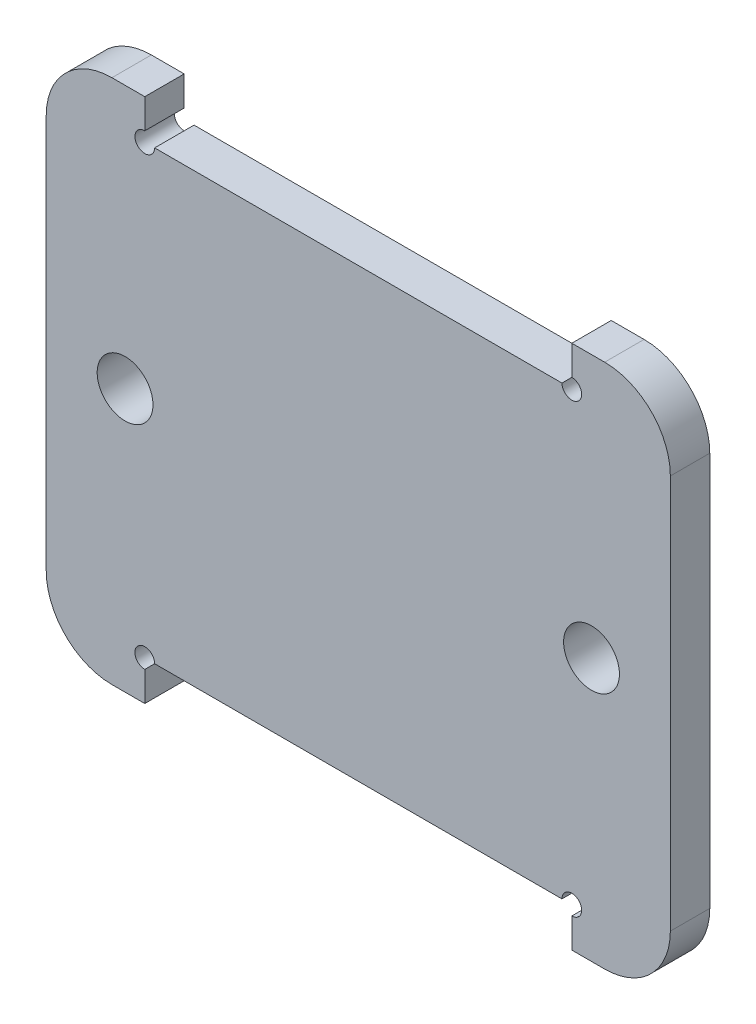
ISO-10303-21;
HEADER;
FILE_DESCRIPTION(('STEP AP214'),'2;1');
FILE_NAME('part.step','',(''),(''),'','','');
FILE_SCHEMA(('AUTOMOTIVE_DESIGN { 1 0 10303 214 1 1 1 1 }'));
ENDSEC;
DATA;
#1=APPLICATION_CONTEXT('core data for automotive mechanical design processes');
#2=APPLICATION_PROTOCOL_DEFINITION('international standard','automotive_design',2000,#1);
#3=PRODUCT_CONTEXT('',#1,'mechanical');
#4=PRODUCT('Part','Part','',(#3));
#5=PRODUCT_RELATED_PRODUCT_CATEGORY('part','',(#4));
#6=PRODUCT_DEFINITION_FORMATION('','',#4);
#7=PRODUCT_DEFINITION_CONTEXT('part definition',#1,'design');
#8=PRODUCT_DEFINITION('design','',#6,#7);
#9=PRODUCT_DEFINITION_SHAPE('','',#8);
#10=(LENGTH_UNIT() NAMED_UNIT(*) SI_UNIT(.MILLI.,.METRE.));
#11=(NAMED_UNIT(*) PLANE_ANGLE_UNIT() SI_UNIT($,.RADIAN.));
#12=(NAMED_UNIT(*) SI_UNIT($,.STERADIAN.) SOLID_ANGLE_UNIT());
#13=UNCERTAINTY_MEASURE_WITH_UNIT(LENGTH_MEASURE(1.E-05),#10,'distance_accuracy_value','');
#14=(GEOMETRIC_REPRESENTATION_CONTEXT(3) GLOBAL_UNCERTAINTY_ASSIGNED_CONTEXT((#13)) GLOBAL_UNIT_ASSIGNED_CONTEXT((#10,
#11,#12)) REPRESENTATION_CONTEXT('',''));
#15=CARTESIAN_POINT('',(0.,0.,0.));
#16=DIRECTION('',(0.,0.,1.));
#17=DIRECTION('',(1.,0.,0.));
#18=AXIS2_PLACEMENT_3D('',#15,#16,#17);
#19=CARTESIAN_POINT('',(-310.,90.,6.00000000000001));
#20=DIRECTION('',(0.,0.,-1.));
#21=DIRECTION('',(-1.,0.,0.));
#22=AXIS2_PLACEMENT_3D('',#19,#20,#21);
#23=PLANE('',#22);
#24=DIRECTION('',(1.,0.,0.));
#25=VECTOR('',#24,1.);
#26=CARTESIAN_POINT('',(-315.,26.,6.00000000000001));
#27=LINE('',#26,#25);
#28=CARTESIAN_POINT('',(-378.5,25.9999999999999,6.00000000000001));
#29=VERTEX_POINT('',#28);
#30=CARTESIAN_POINT('',(-316.5,26.,6.00000000000001));
#31=VERTEX_POINT('',#30);
#32=EDGE_CURVE('E192',#29,#31,#27,.T.);
#33=ORIENTED_EDGE('',*,*,#32,.T.);
#34=CARTESIAN_POINT('',(-315.,25.9999999999999,6.00000000000001));
#35=DIRECTION('',(0.,0.,1.));
#36=DIRECTION('',(-1.,0.,0.));
#37=AXIS2_PLACEMENT_3D('',#34,#35,#36);
#38=CIRCLE('',#37,1.50000000000002);
#39=CARTESIAN_POINT('',(-315.,24.4999999999999,6.00000000000001));
#40=VERTEX_POINT('',#39);
#41=EDGE_CURVE('E174',#40,#31,#38,.T.);
#42=ORIENTED_EDGE('',*,*,#41,.F.);
#43=DIRECTION('',(0.,-1.,0.));
#44=VECTOR('',#43,1.);
#45=CARTESIAN_POINT('',(-315.,20.,6.00000000000001));
#46=LINE('',#45,#44);
#47=CARTESIAN_POINT('',(-315.,20.,6.00000000000001));
#48=VERTEX_POINT('',#47);
#49=EDGE_CURVE('E204',#40,#48,#46,.T.);
#50=ORIENTED_EDGE('',*,*,#49,.T.);
#51=DIRECTION('',(1.,0.,0.));
#52=VECTOR('',#51,1.);
#53=CARTESIAN_POINT('',(-310.,20.,6.00000000000001));
#54=LINE('',#53,#52);
#55=CARTESIAN_POINT('',(-310.,20.,6.00000000000001));
#56=VERTEX_POINT('',#55);
#57=EDGE_CURVE('E210',#48,#56,#54,.T.);
#58=ORIENTED_EDGE('',*,*,#57,.T.);
#59=CARTESIAN_POINT('',(-310.,30.,6.00000000000001));
#60=DIRECTION('',(0.,0.,1.));
#61=DIRECTION('',(-1.,0.,0.));
#62=AXIS2_PLACEMENT_3D('',#59,#60,#61);
#63=CIRCLE('',#62,9.99999999999994);
#64=CARTESIAN_POINT('',(-300.,30.,6.00000000000001));
#65=VERTEX_POINT('',#64);
#66=EDGE_CURVE('E219',#56,#65,#63,.T.);
#67=ORIENTED_EDGE('',*,*,#66,.T.);
#68=DIRECTION('',(0.,1.,0.));
#69=VECTOR('',#68,1.);
#70=CARTESIAN_POINT('',(-300.,90.,6.00000000000001));
#71=LINE('',#70,#69);
#72=CARTESIAN_POINT('',(-300.,90.,6.00000000000001));
#73=VERTEX_POINT('',#72);
#74=EDGE_CURVE('E222',#65,#73,#71,.T.);
#75=ORIENTED_EDGE('',*,*,#74,.T.);
#76=CARTESIAN_POINT('',(-310.,90.,6.00000000000001));
#77=DIRECTION('',(0.,0.,1.));
#78=DIRECTION('',(-1.,0.,0.));
#79=AXIS2_PLACEMENT_3D('',#76,#77,#78);
#80=CIRCLE('',#79,9.99999999999995);
#81=CARTESIAN_POINT('',(-310.,99.9999999999999,6.00000000000001));
#82=VERTEX_POINT('',#81);
#83=EDGE_CURVE('E225',#73,#82,#80,.T.);
#84=ORIENTED_EDGE('',*,*,#83,.T.);
#85=DIRECTION('',(-1.,0.,0.));
#86=VECTOR('',#85,1.);
#87=CARTESIAN_POINT('',(-315.,100.,6.00000000000001));
#88=LINE('',#87,#86);
#89=CARTESIAN_POINT('',(-315.,100.,6.00000000000001));
#90=VERTEX_POINT('',#89);
#91=EDGE_CURVE('E228',#82,#90,#88,.T.);
#92=ORIENTED_EDGE('',*,*,#91,.T.);
#93=DIRECTION('',(0.,-1.,0.));
#94=VECTOR('',#93,1.);
#95=CARTESIAN_POINT('',(-315.,94.,6.00000000000001));
#96=LINE('',#95,#94);
#97=CARTESIAN_POINT('',(-315.,95.5,6.00000000000001));
#98=VERTEX_POINT('',#97);
#99=EDGE_CURVE('E282',#90,#98,#96,.T.);
#100=ORIENTED_EDGE('',*,*,#99,.T.);
#101=CARTESIAN_POINT('',(-315.,93.9999999999999,6.00000000000001));
#102=DIRECTION('',(0.,0.,1.));
#103=DIRECTION('',(1.,0.,0.));
#104=AXIS2_PLACEMENT_3D('',#101,#102,#103);
#105=CIRCLE('',#104,1.50000000000002);
#106=CARTESIAN_POINT('',(-316.5,94.,6.00000000000001));
#107=VERTEX_POINT('',#106);
#108=EDGE_CURVE('E428',#107,#98,#105,.T.);
#109=ORIENTED_EDGE('',*,*,#108,.F.);
#110=DIRECTION('',(-1.,0.,0.));
#111=VECTOR('',#110,1.);
#112=CARTESIAN_POINT('',(-380.,94.,6.00000000000001));
#113=LINE('',#112,#111);
#114=CARTESIAN_POINT('',(-378.5,94.,6.00000000000001));
#115=VERTEX_POINT('',#114);
#116=EDGE_CURVE('E417',#107,#115,#113,.T.);
#117=ORIENTED_EDGE('',*,*,#116,.T.);
#118=CARTESIAN_POINT('',(-380.,93.9999999999999,6.00000000000001));
#119=DIRECTION('',(0.,0.,1.));
#120=DIRECTION('',(-1.,0.,0.));
#121=AXIS2_PLACEMENT_3D('',#118,#119,#120);
#122=CIRCLE('',#121,1.50000000000002);
#123=CARTESIAN_POINT('',(-380.,95.5,6.00000000000001));
#124=VERTEX_POINT('',#123);
#125=EDGE_CURVE('E422',#124,#115,#122,.T.);
#126=ORIENTED_EDGE('',*,*,#125,.F.);
#127=DIRECTION('',(0.,1.,0.));
#128=VECTOR('',#127,1.);
#129=CARTESIAN_POINT('',(-380.,94.,6.00000000000001));
#130=LINE('',#129,#128);
#131=CARTESIAN_POINT('',(-380.,100.,6.00000000000001));
#132=VERTEX_POINT('',#131);
#133=EDGE_CURVE('E340',#124,#132,#130,.T.);
#134=ORIENTED_EDGE('',*,*,#133,.T.);
#135=DIRECTION('',(-1.,0.,0.));
#136=VECTOR('',#135,1.);
#137=CARTESIAN_POINT('',(-380.,100.,6.00000000000001));
#138=LINE('',#137,#136);
#139=CARTESIAN_POINT('',(-385.,100.,6.00000000000001));
#140=VERTEX_POINT('',#139);
#141=EDGE_CURVE('E360',#132,#140,#138,.T.);
#142=ORIENTED_EDGE('',*,*,#141,.T.);
#143=CARTESIAN_POINT('',(-385.,90.,6.00000000000001));
#144=DIRECTION('',(0.,0.,1.));
#145=DIRECTION('',(1.,0.,0.));
#146=AXIS2_PLACEMENT_3D('',#143,#144,#145);
#147=CIRCLE('',#146,9.99999999999995);
#148=CARTESIAN_POINT('',(-395.,90.,6.00000000000001));
#149=VERTEX_POINT('',#148);
#150=EDGE_CURVE('E357',#140,#149,#147,.T.);
#151=ORIENTED_EDGE('',*,*,#150,.T.);
#152=DIRECTION('',(0.,-1.,0.));
#153=VECTOR('',#152,1.);
#154=CARTESIAN_POINT('',(-395.,90.,6.00000000000001));
#155=LINE('',#154,#153);
#156=CARTESIAN_POINT('',(-395.,30.,6.00000000000001));
#157=VERTEX_POINT('',#156);
#158=EDGE_CURVE('E359',#149,#157,#155,.T.);
#159=ORIENTED_EDGE('',*,*,#158,.T.);
#160=CARTESIAN_POINT('',(-385.,30.,6.00000000000001));
#161=DIRECTION('',(0.,0.,1.));
#162=DIRECTION('',(1.,0.,0.));
#163=AXIS2_PLACEMENT_3D('',#160,#161,#162);
#164=CIRCLE('',#163,9.99999999999995);
#165=CARTESIAN_POINT('',(-385.,20.,6.00000000000001));
#166=VERTEX_POINT('',#165);
#167=EDGE_CURVE('E363',#157,#166,#164,.T.);
#168=ORIENTED_EDGE('',*,*,#167,.T.);
#169=DIRECTION('',(1.,0.,0.));
#170=VECTOR('',#169,1.);
#171=CARTESIAN_POINT('',(-385.,20.,6.00000000000001));
#172=LINE('',#171,#170);
#173=CARTESIAN_POINT('',(-380.,20.,6.00000000000001));
#174=VERTEX_POINT('',#173);
#175=EDGE_CURVE('E213',#166,#174,#172,.T.);
#176=ORIENTED_EDGE('',*,*,#175,.T.);
#177=DIRECTION('',(0.,1.,0.));
#178=VECTOR('',#177,1.);
#179=CARTESIAN_POINT('',(-380.,20.,6.00000000000001));
#180=LINE('',#179,#178);
#181=CARTESIAN_POINT('',(-380.,24.4999999999999,6.00000000000001));
#182=VERTEX_POINT('',#181);
#183=EDGE_CURVE('E205',#174,#182,#180,.T.);
#184=ORIENTED_EDGE('',*,*,#183,.T.);
#185=CARTESIAN_POINT('',(-380.,25.9999999999999,6.00000000000001));
#186=DIRECTION('',(0.,0.,1.));
#187=DIRECTION('',(1.,0.,0.));
#188=AXIS2_PLACEMENT_3D('',#185,#186,#187);
#189=CIRCLE('',#188,1.50000000000002);
#190=EDGE_CURVE('E202',#29,#182,#189,.T.);
#191=ORIENTED_EDGE('',*,*,#190,.F.);
#192=EDGE_LOOP('',(#33,#42,#50,#58,#67,#75,#84,#92,#100,#109,#117,#126,#134,#142,#151,#159,#168,
#176,#184,#191));
#193=FACE_BOUND('',#192,.T.);
#194=CARTESIAN_POINT('',(-312.,60.,6.00000000000001));
#195=DIRECTION('',(0.,0.,1.));
#196=DIRECTION('',(1.,0.,0.));
#197=AXIS2_PLACEMENT_3D('',#194,#195,#196);
#198=CIRCLE('',#197,4.24999999999995);
#199=CARTESIAN_POINT('',(-307.75,60.,6.00000000000001));
#200=VERTEX_POINT('',#199);
#201=EDGE_CURVE('E236',#200,#200,#198,.T.);
#202=ORIENTED_EDGE('',*,*,#201,.F.);
#203=EDGE_LOOP('',(#202));
#204=FACE_BOUND('',#203,.T.);
#205=CARTESIAN_POINT('',(-383.,60.,6.00000000000001));
#206=DIRECTION('',(0.,0.,1.));
#207=DIRECTION('',(-1.,0.,0.));
#208=AXIS2_PLACEMENT_3D('',#205,#206,#207);
#209=CIRCLE('',#208,4.24999999999995);
#210=CARTESIAN_POINT('',(-387.25,60.,6.00000000000001));
#211=VERTEX_POINT('',#210);
#212=EDGE_CURVE('E400',#211,#211,#209,.T.);
#213=ORIENTED_EDGE('',*,*,#212,.F.);
#214=EDGE_LOOP('',(#213));
#215=FACE_BOUND('',#214,.T.);
#216=ADVANCED_FACE('F38',(#193,#204,#215),#23,.F.);
#217=CARTESIAN_POINT('',(-310.,90.,0.));
#218=DIRECTION('',(0.,0.,-1.));
#219=DIRECTION('',(-1.,0.,0.));
#220=AXIS2_PLACEMENT_3D('',#217,#218,#219);
#221=PLANE('',#220);
#222=CARTESIAN_POINT('',(-315.,25.9999999999999,0.));
#223=DIRECTION('',(0.,0.,1.));
#224=DIRECTION('',(-1.,0.,0.));
#225=AXIS2_PLACEMENT_3D('',#222,#223,#224);
#226=CIRCLE('',#225,1.50000000000002);
#227=CARTESIAN_POINT('',(-315.,24.4999999999999,0.));
#228=VERTEX_POINT('',#227);
#229=CARTESIAN_POINT('',(-316.5,26.,0.));
#230=VERTEX_POINT('',#229);
#231=EDGE_CURVE('E185',#228,#230,#226,.T.);
#232=ORIENTED_EDGE('',*,*,#231,.T.);
#233=DIRECTION('',(1.,0.,0.));
#234=VECTOR('',#233,1.);
#235=CARTESIAN_POINT('',(-315.,26.,0.));
#236=LINE('',#235,#234);
#237=CARTESIAN_POINT('',(-378.5,25.9999999999999,0.));
#238=VERTEX_POINT('',#237);
#239=EDGE_CURVE('E194',#238,#230,#236,.T.);
#240=ORIENTED_EDGE('',*,*,#239,.F.);
#241=CARTESIAN_POINT('',(-380.,25.9999999999999,0.));
#242=DIRECTION('',(0.,0.,1.));
#243=DIRECTION('',(1.,0.,0.));
#244=AXIS2_PLACEMENT_3D('',#241,#242,#243);
#245=CIRCLE('',#244,1.50000000000002);
#246=CARTESIAN_POINT('',(-380.,24.4999999999999,0.));
#247=VERTEX_POINT('',#246);
#248=EDGE_CURVE('E197',#238,#247,#245,.T.);
#249=ORIENTED_EDGE('',*,*,#248,.T.);
#250=DIRECTION('',(0.,1.,0.));
#251=VECTOR('',#250,1.);
#252=CARTESIAN_POINT('',(-380.,20.,0.));
#253=LINE('',#252,#251);
#254=CARTESIAN_POINT('',(-380.,20.,0.));
#255=VERTEX_POINT('',#254);
#256=EDGE_CURVE('E258',#255,#247,#253,.T.);
#257=ORIENTED_EDGE('',*,*,#256,.F.);
#258=DIRECTION('',(1.,0.,0.));
#259=VECTOR('',#258,1.);
#260=CARTESIAN_POINT('',(-385.,20.,0.));
#261=LINE('',#260,#259);
#262=CARTESIAN_POINT('',(-385.,20.,0.));
#263=VERTEX_POINT('',#262);
#264=EDGE_CURVE('E255',#263,#255,#261,.T.);
#265=ORIENTED_EDGE('',*,*,#264,.F.);
#266=CARTESIAN_POINT('',(-385.,30.,0.));
#267=DIRECTION('',(0.,0.,1.));
#268=DIRECTION('',(1.,0.,0.));
#269=AXIS2_PLACEMENT_3D('',#266,#267,#268);
#270=CIRCLE('',#269,9.99999999999995);
#271=CARTESIAN_POINT('',(-395.,30.,0.));
#272=VERTEX_POINT('',#271);
#273=EDGE_CURVE('E252',#272,#263,#270,.T.);
#274=ORIENTED_EDGE('',*,*,#273,.F.);
#275=DIRECTION('',(0.,-1.,0.));
#276=VECTOR('',#275,1.);
#277=CARTESIAN_POINT('',(-395.,90.,0.));
#278=LINE('',#277,#276);
#279=CARTESIAN_POINT('',(-395.,90.,0.));
#280=VERTEX_POINT('',#279);
#281=EDGE_CURVE('E249',#280,#272,#278,.T.);
#282=ORIENTED_EDGE('',*,*,#281,.F.);
#283=CARTESIAN_POINT('',(-385.,90.,0.));
#284=DIRECTION('',(0.,0.,1.));
#285=DIRECTION('',(1.,0.,0.));
#286=AXIS2_PLACEMENT_3D('',#283,#284,#285);
#287=CIRCLE('',#286,9.99999999999995);
#288=CARTESIAN_POINT('',(-385.,100.,0.));
#289=VERTEX_POINT('',#288);
#290=EDGE_CURVE('E246',#289,#280,#287,.T.);
#291=ORIENTED_EDGE('',*,*,#290,.F.);
#292=DIRECTION('',(-1.,0.,0.));
#293=VECTOR('',#292,1.);
#294=CARTESIAN_POINT('',(-380.,100.,0.));
#295=LINE('',#294,#293);
#296=CARTESIAN_POINT('',(-380.,100.,0.));
#297=VERTEX_POINT('',#296);
#298=EDGE_CURVE('E243',#297,#289,#295,.T.);
#299=ORIENTED_EDGE('',*,*,#298,.F.);
#300=DIRECTION('',(0.,1.,0.));
#301=VECTOR('',#300,1.);
#302=CARTESIAN_POINT('',(-380.,94.,0.));
#303=LINE('',#302,#301);
#304=CARTESIAN_POINT('',(-380.,95.5,0.));
#305=VERTEX_POINT('',#304);
#306=EDGE_CURVE('E240',#305,#297,#303,.T.);
#307=ORIENTED_EDGE('',*,*,#306,.F.);
#308=CARTESIAN_POINT('',(-380.,93.9999999999999,0.));
#309=DIRECTION('',(0.,0.,1.));
#310=DIRECTION('',(-1.,0.,0.));
#311=AXIS2_PLACEMENT_3D('',#308,#309,#310);
#312=CIRCLE('',#311,1.50000000000002);
#313=CARTESIAN_POINT('',(-378.5,94.,0.));
#314=VERTEX_POINT('',#313);
#315=EDGE_CURVE('E61',#305,#314,#312,.T.);
#316=ORIENTED_EDGE('',*,*,#315,.T.);
#317=DIRECTION('',(-1.,0.,0.));
#318=VECTOR('',#317,1.);
#319=CARTESIAN_POINT('',(-380.,94.,0.));
#320=LINE('',#319,#318);
#321=CARTESIAN_POINT('',(-316.5,94.,0.));
#322=VERTEX_POINT('',#321);
#323=EDGE_CURVE('E235',#322,#314,#320,.T.);
#324=ORIENTED_EDGE('',*,*,#323,.F.);
#325=CARTESIAN_POINT('',(-315.,93.9999999999999,0.));
#326=DIRECTION('',(0.,0.,1.));
#327=DIRECTION('',(1.,0.,0.));
#328=AXIS2_PLACEMENT_3D('',#325,#326,#327);
#329=CIRCLE('',#328,1.50000000000002);
#330=CARTESIAN_POINT('',(-315.,95.5,0.));
#331=VERTEX_POINT('',#330);
#332=EDGE_CURVE('E54',#322,#331,#329,.T.);
#333=ORIENTED_EDGE('',*,*,#332,.T.);
#334=DIRECTION('',(0.,-1.,0.));
#335=VECTOR('',#334,1.);
#336=CARTESIAN_POINT('',(-315.,94.,0.));
#337=LINE('',#336,#335);
#338=CARTESIAN_POINT('',(-315.,100.,0.));
#339=VERTEX_POINT('',#338);
#340=EDGE_CURVE('E231',#339,#331,#337,.T.);
#341=ORIENTED_EDGE('',*,*,#340,.F.);
#342=DIRECTION('',(-1.,0.,0.));
#343=VECTOR('',#342,1.);
#344=CARTESIAN_POINT('',(-315.,100.,0.));
#345=LINE('',#344,#343);
#346=CARTESIAN_POINT('',(-310.,99.9999999999999,0.));
#347=VERTEX_POINT('',#346);
#348=EDGE_CURVE('E279',#347,#339,#345,.T.);
#349=ORIENTED_EDGE('',*,*,#348,.F.);
#350=CARTESIAN_POINT('',(-310.,90.,0.));
#351=DIRECTION('',(0.,0.,1.));
#352=DIRECTION('',(-1.,0.,0.));
#353=AXIS2_PLACEMENT_3D('',#350,#351,#352);
#354=CIRCLE('',#353,9.99999999999995);
#355=CARTESIAN_POINT('',(-300.,90.,0.));
#356=VERTEX_POINT('',#355);
#357=EDGE_CURVE('E276',#356,#347,#354,.T.);
#358=ORIENTED_EDGE('',*,*,#357,.F.);
#359=DIRECTION('',(0.,1.,0.));
#360=VECTOR('',#359,1.);
#361=CARTESIAN_POINT('',(-300.,90.,0.));
#362=LINE('',#361,#360);
#363=CARTESIAN_POINT('',(-300.,30.,0.));
#364=VERTEX_POINT('',#363);
#365=EDGE_CURVE('E273',#364,#356,#362,.T.);
#366=ORIENTED_EDGE('',*,*,#365,.F.);
#367=CARTESIAN_POINT('',(-310.,30.,0.));
#368=DIRECTION('',(0.,0.,1.));
#369=DIRECTION('',(-1.,0.,0.));
#370=AXIS2_PLACEMENT_3D('',#367,#368,#369);
#371=CIRCLE('',#370,9.99999999999994);
#372=CARTESIAN_POINT('',(-310.,20.,0.));
#373=VERTEX_POINT('',#372);
#374=EDGE_CURVE('E270',#373,#364,#371,.T.);
#375=ORIENTED_EDGE('',*,*,#374,.F.);
#376=DIRECTION('',(1.,0.,0.));
#377=VECTOR('',#376,1.);
#378=CARTESIAN_POINT('',(-310.,20.,0.));
#379=LINE('',#378,#377);
#380=CARTESIAN_POINT('',(-315.,20.,0.));
#381=VERTEX_POINT('',#380);
#382=EDGE_CURVE('E267',#381,#373,#379,.T.);
#383=ORIENTED_EDGE('',*,*,#382,.F.);
#384=DIRECTION('',(0.,-1.,0.));
#385=VECTOR('',#384,1.);
#386=CARTESIAN_POINT('',(-315.,20.,0.));
#387=LINE('',#386,#385);
#388=EDGE_CURVE('E264',#228,#381,#387,.T.);
#389=ORIENTED_EDGE('',*,*,#388,.F.);
#390=EDGE_LOOP('',(#232,#240,#249,#257,#265,#274,#282,#291,#299,#307,#316,#324,#333,#341,#349,
#358,#366,#375,#383,#389));
#391=FACE_BOUND('',#390,.T.);
#392=CARTESIAN_POINT('',(-312.,60.,0.));
#393=DIRECTION('',(0.,0.,1.));
#394=DIRECTION('',(1.,0.,0.));
#395=AXIS2_PLACEMENT_3D('',#392,#393,#394);
#396=CIRCLE('',#395,4.24999999999995);
#397=CARTESIAN_POINT('',(-307.75,60.,0.));
#398=VERTEX_POINT('',#397);
#399=EDGE_CURVE('E404',#398,#398,#396,.T.);
#400=ORIENTED_EDGE('',*,*,#399,.T.);
#401=EDGE_LOOP('',(#400));
#402=FACE_BOUND('',#401,.T.);
#403=CARTESIAN_POINT('',(-383.,60.,0.));
#404=DIRECTION('',(0.,0.,1.));
#405=DIRECTION('',(-1.,0.,0.));
#406=AXIS2_PLACEMENT_3D('',#403,#404,#405);
#407=CIRCLE('',#406,4.24999999999995);
#408=CARTESIAN_POINT('',(-387.25,60.,0.));
#409=VERTEX_POINT('',#408);
#410=EDGE_CURVE('E399',#409,#409,#407,.T.);
#411=ORIENTED_EDGE('',*,*,#410,.T.);
#412=EDGE_LOOP('',(#411));
#413=FACE_BOUND('',#412,.T.);
#414=ADVANCED_FACE('F344',(#391,#402,#413),#221,.T.);
#415=CARTESIAN_POINT('',(-315.,94.,6.00000000000001));
#416=DIRECTION('',(1.,0.,0.));
#417=DIRECTION('',(0.,0.,-1.));
#418=AXIS2_PLACEMENT_3D('',#415,#416,#417);
#419=PLANE('',#418);
#420=ORIENTED_EDGE('',*,*,#340,.T.);
#421=DIRECTION('',(0.,0.,1.));
#422=VECTOR('',#421,1.);
#423=CARTESIAN_POINT('',(-315.,95.5,0.));
#424=LINE('',#423,#422);
#425=EDGE_CURVE('E392',#331,#98,#424,.T.);
#426=ORIENTED_EDGE('',*,*,#425,.T.);
#427=ORIENTED_EDGE('',*,*,#99,.F.);
#428=DIRECTION('',(0.,0.,-1.));
#429=VECTOR('',#428,1.);
#430=CARTESIAN_POINT('',(-315.,100.,6.00000000000001));
#431=LINE('',#430,#429);
#432=EDGE_CURVE('E230',#90,#339,#431,.T.);
#433=ORIENTED_EDGE('',*,*,#432,.T.);
#434=EDGE_LOOP('',(#420,#426,#427,#433));
#435=FACE_BOUND('',#434,.T.);
#436=ADVANCED_FACE('F40',(#435),#419,.F.);
#437=CARTESIAN_POINT('',(-380.,94.,6.00000000000001));
#438=DIRECTION('',(0.,-1.,0.));
#439=DIRECTION('',(0.,0.,-1.));
#440=AXIS2_PLACEMENT_3D('',#437,#438,#439);
#441=PLANE('',#440);
#442=ORIENTED_EDGE('',*,*,#323,.T.);
#443=DIRECTION('',(0.,0.,1.));
#444=VECTOR('',#443,1.);
#445=CARTESIAN_POINT('',(-378.5,94.,0.));
#446=LINE('',#445,#444);
#447=EDGE_CURVE('E387',#314,#115,#446,.T.);
#448=ORIENTED_EDGE('',*,*,#447,.T.);
#449=ORIENTED_EDGE('',*,*,#116,.F.);
#450=DIRECTION('',(0.,0.,1.));
#451=VECTOR('',#450,1.);
#452=CARTESIAN_POINT('',(-316.5,94.,0.));
#453=LINE('',#452,#451);
#454=EDGE_CURVE('E11',#107,#322,#453,.F.);
#455=ORIENTED_EDGE('',*,*,#454,.T.);
#456=EDGE_LOOP('',(#442,#448,#449,#455));
#457=FACE_BOUND('',#456,.T.);
#458=ADVANCED_FACE('F450',(#457),#441,.F.);
#459=CARTESIAN_POINT('',(-380.,94.,6.00000000000001));
#460=DIRECTION('',(-1.,0.,0.));
#461=DIRECTION('',(0.,0.,1.));
#462=AXIS2_PLACEMENT_3D('',#459,#460,#461);
#463=PLANE('',#462);
#464=ORIENTED_EDGE('',*,*,#133,.F.);
#465=DIRECTION('',(0.,0.,1.));
#466=VECTOR('',#465,1.);
#467=CARTESIAN_POINT('',(-380.,95.5,0.));
#468=LINE('',#467,#466);
#469=EDGE_CURVE('E47',#124,#305,#468,.F.);
#470=ORIENTED_EDGE('',*,*,#469,.T.);
#471=ORIENTED_EDGE('',*,*,#306,.T.);
#472=DIRECTION('',(0.,0.,-1.));
#473=VECTOR('',#472,1.);
#474=CARTESIAN_POINT('',(-380.,100.,6.00000000000001));
#475=LINE('',#474,#473);
#476=EDGE_CURVE('E325',#132,#297,#475,.T.);
#477=ORIENTED_EDGE('',*,*,#476,.F.);
#478=EDGE_LOOP('',(#464,#470,#471,#477));
#479=FACE_BOUND('',#478,.T.);
#480=ADVANCED_FACE('F338',(#479),#463,.F.);
#481=CARTESIAN_POINT('',(-380.,100.,6.00000000000001));
#482=DIRECTION('',(0.,-1.,0.));
#483=DIRECTION('',(0.,0.,-1.));
#484=AXIS2_PLACEMENT_3D('',#481,#482,#483);
#485=PLANE('',#484);
#486=ORIENTED_EDGE('',*,*,#298,.T.);
#487=DIRECTION('',(0.,0.,-1.));
#488=VECTOR('',#487,1.);
#489=CARTESIAN_POINT('',(-385.,100.,6.00000000000001));
#490=LINE('',#489,#488);
#491=EDGE_CURVE('E321',#140,#289,#490,.T.);
#492=ORIENTED_EDGE('',*,*,#491,.F.);
#493=ORIENTED_EDGE('',*,*,#141,.F.);
#494=ORIENTED_EDGE('',*,*,#476,.T.);
#495=EDGE_LOOP('',(#486,#492,#493,#494));
#496=FACE_BOUND('',#495,.T.);
#497=ADVANCED_FACE('F351',(#496),#485,.F.);
#498=CARTESIAN_POINT('',(-385.,90.,6.00000000000001));
#499=DIRECTION('',(0.,0.,-1.));
#500=DIRECTION('',(-1.,0.,0.));
#501=AXIS2_PLACEMENT_3D('',#498,#499,#500);
#502=CYLINDRICAL_SURFACE('',#501,9.99999999999995);
#503=ORIENTED_EDGE('',*,*,#290,.T.);
#504=DIRECTION('',(0.,0.,-1.));
#505=VECTOR('',#504,1.);
#506=CARTESIAN_POINT('',(-395.,90.,6.00000000000001));
#507=LINE('',#506,#505);
#508=EDGE_CURVE('E317',#149,#280,#507,.T.);
#509=ORIENTED_EDGE('',*,*,#508,.F.);
#510=ORIENTED_EDGE('',*,*,#150,.F.);
#511=ORIENTED_EDGE('',*,*,#491,.T.);
#512=EDGE_LOOP('',(#503,#509,#510,#511));
#513=FACE_BOUND('',#512,.T.);
#514=ADVANCED_FACE('F355',(#513),#502,.T.);
#515=CARTESIAN_POINT('',(-395.,90.,6.00000000000001));
#516=DIRECTION('',(1.,0.,0.));
#517=DIRECTION('',(0.,0.,-1.));
#518=AXIS2_PLACEMENT_3D('',#515,#516,#517);
#519=PLANE('',#518);
#520=ORIENTED_EDGE('',*,*,#281,.T.);
#521=DIRECTION('',(0.,0.,-1.));
#522=VECTOR('',#521,1.);
#523=CARTESIAN_POINT('',(-395.,30.,6.00000000000001));
#524=LINE('',#523,#522);
#525=EDGE_CURVE('E313',#157,#272,#524,.T.);
#526=ORIENTED_EDGE('',*,*,#525,.F.);
#527=ORIENTED_EDGE('',*,*,#158,.F.);
#528=ORIENTED_EDGE('',*,*,#508,.T.);
#529=EDGE_LOOP('',(#520,#526,#527,#528));
#530=FACE_BOUND('',#529,.T.);
#531=ADVANCED_FACE('F503',(#530),#519,.F.);
#532=CARTESIAN_POINT('',(-385.,30.,6.00000000000001));
#533=DIRECTION('',(0.,0.,-1.));
#534=DIRECTION('',(-1.,0.,0.));
#535=AXIS2_PLACEMENT_3D('',#532,#533,#534);
#536=CYLINDRICAL_SURFACE('',#535,9.99999999999995);
#537=ORIENTED_EDGE('',*,*,#273,.T.);
#538=DIRECTION('',(0.,0.,-1.));
#539=VECTOR('',#538,1.);
#540=CARTESIAN_POINT('',(-385.,20.,6.00000000000001));
#541=LINE('',#540,#539);
#542=EDGE_CURVE('E309',#166,#263,#541,.T.);
#543=ORIENTED_EDGE('',*,*,#542,.F.);
#544=ORIENTED_EDGE('',*,*,#167,.F.);
#545=ORIENTED_EDGE('',*,*,#525,.T.);
#546=EDGE_LOOP('',(#537,#543,#544,#545));
#547=FACE_BOUND('',#546,.T.);
#548=ADVANCED_FACE('F500',(#547),#536,.T.);
#549=CARTESIAN_POINT('',(-385.,20.,6.00000000000001));
#550=DIRECTION('',(0.,1.,0.));
#551=DIRECTION('',(-1.,0.,0.));
#552=AXIS2_PLACEMENT_3D('',#549,#550,#551);
#553=PLANE('',#552);
#554=ORIENTED_EDGE('',*,*,#264,.T.);
#555=DIRECTION('',(0.,0.,-1.));
#556=VECTOR('',#555,1.);
#557=CARTESIAN_POINT('',(-380.,20.,6.00000000000001));
#558=LINE('',#557,#556);
#559=EDGE_CURVE('E305',#174,#255,#558,.T.);
#560=ORIENTED_EDGE('',*,*,#559,.F.);
#561=ORIENTED_EDGE('',*,*,#175,.F.);
#562=ORIENTED_EDGE('',*,*,#542,.T.);
#563=EDGE_LOOP('',(#554,#560,#561,#562));
#564=FACE_BOUND('',#563,.T.);
#565=ADVANCED_FACE('F378',(#564),#553,.F.);
#566=CARTESIAN_POINT('',(-380.,20.,6.00000000000001));
#567=DIRECTION('',(-1.,0.,0.));
#568=DIRECTION('',(0.,0.,1.));
#569=AXIS2_PLACEMENT_3D('',#566,#567,#568);
#570=PLANE('',#569);
#571=ORIENTED_EDGE('',*,*,#256,.T.);
#572=DIRECTION('',(0.,0.,1.));
#573=VECTOR('',#572,1.);
#574=CARTESIAN_POINT('',(-380.,24.4999999999999,0.));
#575=LINE('',#574,#573);
#576=EDGE_CURVE('E196',#247,#182,#575,.T.);
#577=ORIENTED_EDGE('',*,*,#576,.T.);
#578=ORIENTED_EDGE('',*,*,#183,.F.);
#579=ORIENTED_EDGE('',*,*,#559,.T.);
#580=EDGE_LOOP('',(#571,#577,#578,#579));
#581=FACE_BOUND('',#580,.T.);
#582=ADVANCED_FACE('F383',(#581),#570,.F.);
#583=CARTESIAN_POINT('',(-315.,26.,6.00000000000001));
#584=DIRECTION('',(0.,1.,0.));
#585=DIRECTION('',(-1.,0.,0.));
#586=AXIS2_PLACEMENT_3D('',#583,#584,#585);
#587=PLANE('',#586);
#588=ORIENTED_EDGE('',*,*,#239,.T.);
#589=DIRECTION('',(0.,0.,1.));
#590=VECTOR('',#589,1.);
#591=CARTESIAN_POINT('',(-316.5,26.,0.));
#592=LINE('',#591,#590);
#593=EDGE_CURVE('E177',#230,#31,#592,.T.);
#594=ORIENTED_EDGE('',*,*,#593,.T.);
#595=ORIENTED_EDGE('',*,*,#32,.F.);
#596=DIRECTION('',(0.,0.,1.));
#597=VECTOR('',#596,1.);
#598=CARTESIAN_POINT('',(-378.5,25.9999999999999,0.));
#599=LINE('',#598,#597);
#600=EDGE_CURVE('E331',#29,#238,#599,.F.);
#601=ORIENTED_EDGE('',*,*,#600,.T.);
#602=EDGE_LOOP('',(#588,#594,#595,#601));
#603=FACE_BOUND('',#602,.T.);
#604=ADVANCED_FACE('F190',(#603),#587,.F.);
#605=CARTESIAN_POINT('',(-315.,20.,6.00000000000001));
#606=DIRECTION('',(1.,0.,0.));
#607=DIRECTION('',(0.,0.,-1.));
#608=AXIS2_PLACEMENT_3D('',#605,#606,#607);
#609=PLANE('',#608);
#610=ORIENTED_EDGE('',*,*,#49,.F.);
#611=DIRECTION('',(0.,0.,1.));
#612=VECTOR('',#611,1.);
#613=CARTESIAN_POINT('',(-315.,24.4999999999999,0.));
#614=LINE('',#613,#612);
#615=EDGE_CURVE('E180',#40,#228,#614,.F.);
#616=ORIENTED_EDGE('',*,*,#615,.T.);
#617=ORIENTED_EDGE('',*,*,#388,.T.);
#618=DIRECTION('',(0.,0.,-1.));
#619=VECTOR('',#618,1.);
#620=CARTESIAN_POINT('',(-315.,20.,6.00000000000001));
#621=LINE('',#620,#619);
#622=EDGE_CURVE('E301',#48,#381,#621,.T.);
#623=ORIENTED_EDGE('',*,*,#622,.F.);
#624=EDGE_LOOP('',(#610,#616,#617,#623));
#625=FACE_BOUND('',#624,.T.);
#626=ADVANCED_FACE('F489',(#625),#609,.F.);
#627=CARTESIAN_POINT('',(-310.,20.,6.00000000000001));
#628=DIRECTION('',(0.,1.,0.));
#629=DIRECTION('',(0.,0.,1.));
#630=AXIS2_PLACEMENT_3D('',#627,#628,#629);
#631=PLANE('',#630);
#632=ORIENTED_EDGE('',*,*,#382,.T.);
#633=DIRECTION('',(0.,0.,-1.));
#634=VECTOR('',#633,1.);
#635=CARTESIAN_POINT('',(-310.,20.,6.00000000000001));
#636=LINE('',#635,#634);
#637=EDGE_CURVE('E297',#56,#373,#636,.T.);
#638=ORIENTED_EDGE('',*,*,#637,.F.);
#639=ORIENTED_EDGE('',*,*,#57,.F.);
#640=ORIENTED_EDGE('',*,*,#622,.T.);
#641=EDGE_LOOP('',(#632,#638,#639,#640));
#642=FACE_BOUND('',#641,.T.);
#643=ADVANCED_FACE('F485',(#642),#631,.F.);
#644=CARTESIAN_POINT('',(-310.,30.,6.00000000000001));
#645=DIRECTION('',(0.,0.,-1.));
#646=DIRECTION('',(-1.,0.,0.));
#647=AXIS2_PLACEMENT_3D('',#644,#645,#646);
#648=CYLINDRICAL_SURFACE('',#647,9.99999999999994);
#649=ORIENTED_EDGE('',*,*,#374,.T.);
#650=DIRECTION('',(0.,0.,-1.));
#651=VECTOR('',#650,1.);
#652=CARTESIAN_POINT('',(-300.,30.,6.00000000000001));
#653=LINE('',#652,#651);
#654=EDGE_CURVE('E294',#65,#364,#653,.T.);
#655=ORIENTED_EDGE('',*,*,#654,.F.);
#656=ORIENTED_EDGE('',*,*,#66,.F.);
#657=ORIENTED_EDGE('',*,*,#637,.T.);
#658=EDGE_LOOP('',(#649,#655,#656,#657));
#659=FACE_BOUND('',#658,.T.);
#660=ADVANCED_FACE('F481',(#659),#648,.T.);
#661=CARTESIAN_POINT('',(-300.,90.,6.00000000000001));
#662=DIRECTION('',(-1.,0.,0.));
#663=DIRECTION('',(0.,0.,1.));
#664=AXIS2_PLACEMENT_3D('',#661,#662,#663);
#665=PLANE('',#664);
#666=ORIENTED_EDGE('',*,*,#365,.T.);
#667=DIRECTION('',(0.,0.,-1.));
#668=VECTOR('',#667,1.);
#669=CARTESIAN_POINT('',(-300.,90.,6.00000000000001));
#670=LINE('',#669,#668);
#671=EDGE_CURVE('E290',#73,#356,#670,.T.);
#672=ORIENTED_EDGE('',*,*,#671,.F.);
#673=ORIENTED_EDGE('',*,*,#74,.F.);
#674=ORIENTED_EDGE('',*,*,#654,.T.);
#675=EDGE_LOOP('',(#666,#672,#673,#674));
#676=FACE_BOUND('',#675,.T.);
#677=ADVANCED_FACE('F477',(#676),#665,.F.);
#678=CARTESIAN_POINT('',(-310.,90.,6.00000000000001));
#679=DIRECTION('',(0.,0.,-1.));
#680=DIRECTION('',(-1.,0.,0.));
#681=AXIS2_PLACEMENT_3D('',#678,#679,#680);
#682=CYLINDRICAL_SURFACE('',#681,9.99999999999995);
#683=ORIENTED_EDGE('',*,*,#357,.T.);
#684=DIRECTION('',(0.,0.,-1.));
#685=VECTOR('',#684,1.);
#686=CARTESIAN_POINT('',(-310.,99.9999999999999,6.00000000000001));
#687=LINE('',#686,#685);
#688=EDGE_CURVE('E286',#82,#347,#687,.T.);
#689=ORIENTED_EDGE('',*,*,#688,.F.);
#690=ORIENTED_EDGE('',*,*,#83,.F.);
#691=ORIENTED_EDGE('',*,*,#671,.T.);
#692=EDGE_LOOP('',(#683,#689,#690,#691));
#693=FACE_BOUND('',#692,.T.);
#694=ADVANCED_FACE('F474',(#693),#682,.T.);
#695=CARTESIAN_POINT('',(-315.,100.,6.00000000000001));
#696=DIRECTION('',(0.,-1.,0.));
#697=DIRECTION('',(0.,0.,-1.));
#698=AXIS2_PLACEMENT_3D('',#695,#696,#697);
#699=PLANE('',#698);
#700=ORIENTED_EDGE('',*,*,#348,.T.);
#701=ORIENTED_EDGE('',*,*,#432,.F.);
#702=ORIENTED_EDGE('',*,*,#91,.F.);
#703=ORIENTED_EDGE('',*,*,#688,.T.);
#704=EDGE_LOOP('',(#700,#701,#702,#703));
#705=FACE_BOUND('',#704,.T.);
#706=ADVANCED_FACE('F446',(#705),#699,.F.);
#707=CARTESIAN_POINT('',(-312.,60.,6.00000000000001));
#708=DIRECTION('',(0.,0.,-1.));
#709=DIRECTION('',(-1.,0.,0.));
#710=AXIS2_PLACEMENT_3D('',#707,#708,#709);
#711=CYLINDRICAL_SURFACE('',#710,4.24999999999995);
#712=ORIENTED_EDGE('',*,*,#201,.T.);
#713=EDGE_LOOP('',(#712));
#714=FACE_BOUND('',#713,.T.);
#715=ORIENTED_EDGE('',*,*,#399,.F.);
#716=EDGE_LOOP('',(#715));
#717=FACE_BOUND('',#716,.T.);
#718=ADVANCED_FACE('F469',(#714,#717),#711,.F.);
#719=CARTESIAN_POINT('',(-383.,60.,6.00000000000001));
#720=DIRECTION('',(0.,0.,-1.));
#721=DIRECTION('',(-1.,0.,0.));
#722=AXIS2_PLACEMENT_3D('',#719,#720,#721);
#723=CYLINDRICAL_SURFACE('',#722,4.24999999999995);
#724=ORIENTED_EDGE('',*,*,#212,.T.);
#725=EDGE_LOOP('',(#724));
#726=FACE_BOUND('',#725,.T.);
#727=ORIENTED_EDGE('',*,*,#410,.F.);
#728=EDGE_LOOP('',(#727));
#729=FACE_BOUND('',#728,.T.);
#730=ADVANCED_FACE('F616',(#726,#729),#723,.F.);
#731=CARTESIAN_POINT('',(-315.,25.9999999999999,0.));
#732=DIRECTION('',(0.,0.,1.));
#733=DIRECTION('',(1.,0.,0.));
#734=AXIS2_PLACEMENT_3D('',#731,#732,#733);
#735=CYLINDRICAL_SURFACE('',#734,1.50000000000002);
#736=ORIENTED_EDGE('',*,*,#231,.F.);
#737=ORIENTED_EDGE('',*,*,#615,.F.);
#738=ORIENTED_EDGE('',*,*,#41,.T.);
#739=ORIENTED_EDGE('',*,*,#593,.F.);
#740=EDGE_LOOP('',(#736,#737,#738,#739));
#741=FACE_BOUND('',#740,.T.);
#742=ADVANCED_FACE('F176',(#741),#735,.F.);
#743=CARTESIAN_POINT('',(-380.,25.9999999999999,0.));
#744=DIRECTION('',(0.,0.,1.));
#745=DIRECTION('',(1.,0.,0.));
#746=AXIS2_PLACEMENT_3D('',#743,#744,#745);
#747=CYLINDRICAL_SURFACE('',#746,1.50000000000002);
#748=ORIENTED_EDGE('',*,*,#248,.F.);
#749=ORIENTED_EDGE('',*,*,#600,.F.);
#750=ORIENTED_EDGE('',*,*,#190,.T.);
#751=ORIENTED_EDGE('',*,*,#576,.F.);
#752=EDGE_LOOP('',(#748,#749,#750,#751));
#753=FACE_BOUND('',#752,.T.);
#754=ADVANCED_FACE('F453',(#753),#747,.F.);
#755=CARTESIAN_POINT('',(-380.,93.9999999999999,0.));
#756=DIRECTION('',(0.,0.,1.));
#757=DIRECTION('',(1.,0.,0.));
#758=AXIS2_PLACEMENT_3D('',#755,#756,#757);
#759=CYLINDRICAL_SURFACE('',#758,1.50000000000002);
#760=ORIENTED_EDGE('',*,*,#315,.F.);
#761=ORIENTED_EDGE('',*,*,#469,.F.);
#762=ORIENTED_EDGE('',*,*,#125,.T.);
#763=ORIENTED_EDGE('',*,*,#447,.F.);
#764=EDGE_LOOP('',(#760,#761,#762,#763));
#765=FACE_BOUND('',#764,.T.);
#766=ADVANCED_FACE('F451',(#765),#759,.F.);
#767=CARTESIAN_POINT('',(-315.,93.9999999999999,0.));
#768=DIRECTION('',(0.,0.,1.));
#769=DIRECTION('',(1.,0.,0.));
#770=AXIS2_PLACEMENT_3D('',#767,#768,#769);
#771=CYLINDRICAL_SURFACE('',#770,1.50000000000002);
#772=ORIENTED_EDGE('',*,*,#332,.F.);
#773=ORIENTED_EDGE('',*,*,#454,.F.);
#774=ORIENTED_EDGE('',*,*,#108,.T.);
#775=ORIENTED_EDGE('',*,*,#425,.F.);
#776=EDGE_LOOP('',(#772,#773,#774,#775));
#777=FACE_BOUND('',#776,.T.);
#778=ADVANCED_FACE('F437',(#777),#771,.F.);
#779=CLOSED_SHELL('',(#216,#414,#436,#458,#480,#497,#514,#531,#548,#565,#582,#604,#626,#643,
#660,#677,#694,#706,#718,#730,#742,#754,#766,#778));
#780=MANIFOLD_SOLID_BREP('B2',#779);
#781=ADVANCED_BREP_SHAPE_REPRESENTATION('',(#18,#780),#14);
#782=SHAPE_DEFINITION_REPRESENTATION(#9,#781);
ENDSEC;
END-ISO-10303-21;
